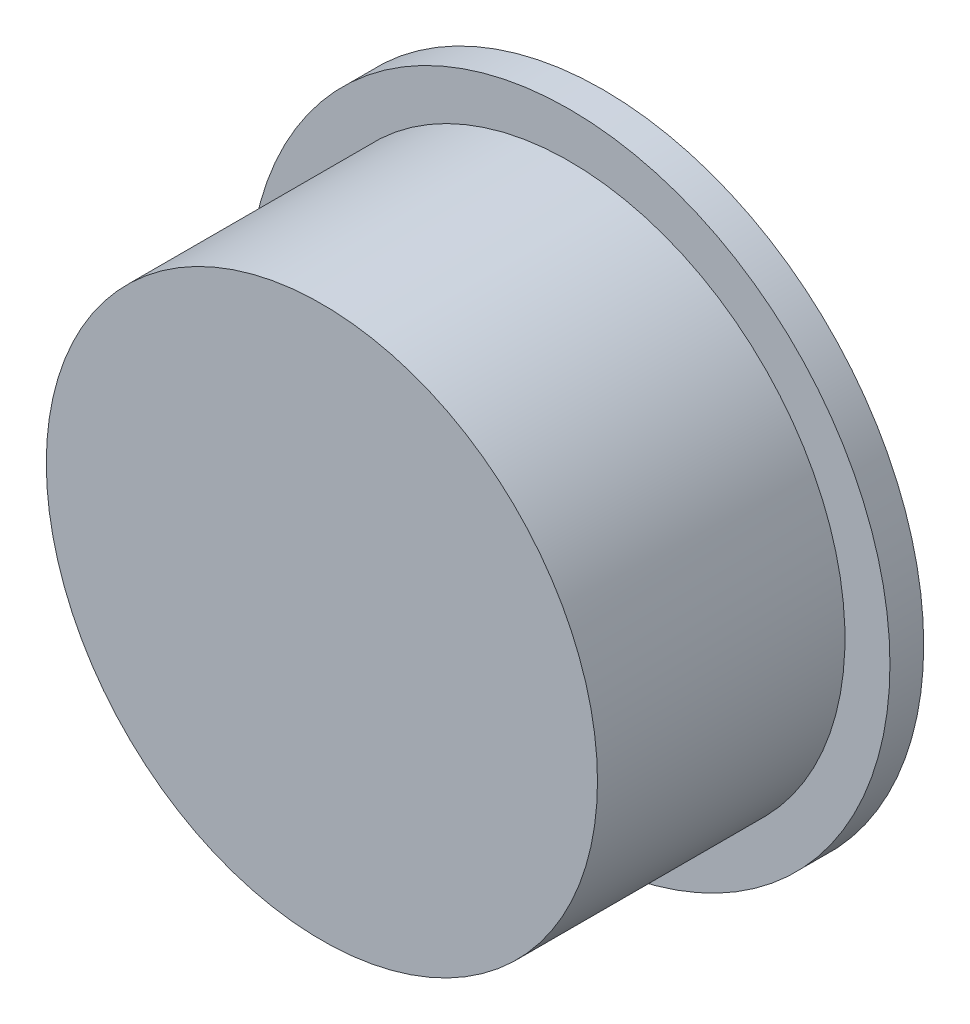
ISO-10303-21;
HEADER;
FILE_DESCRIPTION(('STEP AP214'),'2;1');
FILE_NAME('part.step','',(''),(''),'','','');
FILE_SCHEMA(('AUTOMOTIVE_DESIGN { 1 0 10303 214 1 1 1 1 }'));
ENDSEC;
DATA;
#1=APPLICATION_CONTEXT('core data for automotive mechanical design processes');
#2=APPLICATION_PROTOCOL_DEFINITION('international standard','automotive_design',2000,#1);
#3=PRODUCT_CONTEXT('',#1,'mechanical');
#4=PRODUCT('Part','Part','',(#3));
#5=PRODUCT_RELATED_PRODUCT_CATEGORY('part','',(#4));
#6=PRODUCT_DEFINITION_FORMATION('','',#4);
#7=PRODUCT_DEFINITION_CONTEXT('part definition',#1,'design');
#8=PRODUCT_DEFINITION('design','',#6,#7);
#9=PRODUCT_DEFINITION_SHAPE('','',#8);
#10=(LENGTH_UNIT() NAMED_UNIT(*) SI_UNIT(.MILLI.,.METRE.));
#11=(NAMED_UNIT(*) PLANE_ANGLE_UNIT() SI_UNIT($,.RADIAN.));
#12=(NAMED_UNIT(*) SI_UNIT($,.STERADIAN.) SOLID_ANGLE_UNIT());
#13=UNCERTAINTY_MEASURE_WITH_UNIT(LENGTH_MEASURE(1.E-05),#10,'distance_accuracy_value','');
#14=(GEOMETRIC_REPRESENTATION_CONTEXT(3) GLOBAL_UNCERTAINTY_ASSIGNED_CONTEXT((#13)) GLOBAL_UNIT_ASSIGNED_CONTEXT((#10,
#11,#12)) REPRESENTATION_CONTEXT('',''));
#15=CARTESIAN_POINT('',(0.,0.,0.));
#16=DIRECTION('',(0.,0.,1.));
#17=DIRECTION('',(1.,0.,0.));
#18=AXIS2_PLACEMENT_3D('',#15,#16,#17);
#19=CARTESIAN_POINT('',(-8.52273298087376,9.177701176131,10.));
#20=DIRECTION('',(0.,0.,-1.));
#21=DIRECTION('',(-1.,0.,0.));
#22=AXIS2_PLACEMENT_3D('',#19,#20,#21);
#23=CYLINDRICAL_SURFACE('',#22,22.5);
#24=CARTESIAN_POINT('',(-8.52273298087376,9.177701176131,8.));
#25=DIRECTION('',(0.,0.,1.));
#26=DIRECTION('',(1.,0.,0.));
#27=AXIS2_PLACEMENT_3D('',#24,#25,#26);
#28=CIRCLE('',#27,22.5);
#29=CARTESIAN_POINT('',(13.9772670191262,9.177701176131,8.));
#30=VERTEX_POINT('',#29);
#31=EDGE_CURVE('E159',#30,#30,#28,.T.);
#32=ORIENTED_EDGE('',*,*,#31,.T.);
#33=EDGE_LOOP('',(#32));
#34=FACE_BOUND('',#33,.T.);
#35=CARTESIAN_POINT('',(-8.52273298087376,9.177701176131,-13.));
#36=DIRECTION('',(0.,0.,-1.));
#37=DIRECTION('',(-1.,0.,0.));
#38=AXIS2_PLACEMENT_3D('',#35,#36,#37);
#39=CIRCLE('',#38,22.5);
#40=CARTESIAN_POINT('',(13.4146779876065,4.177701176131,-13.));
#41=VERTEX_POINT('',#40);
#42=CARTESIAN_POINT('',(13.4146779876065,14.177701176131,-13.));
#43=VERTEX_POINT('',#42);
#44=EDGE_CURVE('E125',#41,#43,#39,.F.);
#45=ORIENTED_EDGE('',*,*,#44,.F.);
#46=DIRECTION('',(0.,0.,-1.));
#47=VECTOR('',#46,1.);
#48=CARTESIAN_POINT('',(13.4146779876065,4.177701176131,-13.));
#49=LINE('',#48,#47);
#50=CARTESIAN_POINT('',(13.4146779876065,4.177701176131,-15.));
#51=VERTEX_POINT('',#50);
#52=EDGE_CURVE('E169',#41,#51,#49,.T.);
#53=ORIENTED_EDGE('',*,*,#52,.T.);
#54=CARTESIAN_POINT('',(-8.52273298087376,9.177701176131,-15.));
#55=DIRECTION('',(0.,0.,1.));
#56=DIRECTION('',(1.,0.,0.));
#57=AXIS2_PLACEMENT_3D('',#54,#55,#56);
#58=CIRCLE('',#57,22.5);
#59=CARTESIAN_POINT('',(-30.4601439493541,4.177701176131,-15.));
#60=VERTEX_POINT('',#59);
#61=EDGE_CURVE('E175',#60,#51,#58,.T.);
#62=ORIENTED_EDGE('',*,*,#61,.F.);
#63=DIRECTION('',(0.,0.,-1.));
#64=VECTOR('',#63,1.);
#65=CARTESIAN_POINT('',(-30.4601439493541,4.177701176131,-13.));
#66=LINE('',#65,#64);
#67=CARTESIAN_POINT('',(-30.4601439493541,4.177701176131,-13.));
#68=VERTEX_POINT('',#67);
#69=EDGE_CURVE('E163',#68,#60,#66,.T.);
#70=ORIENTED_EDGE('',*,*,#69,.F.);
#71=CARTESIAN_POINT('',(-8.52273298087376,9.177701176131,-13.));
#72=DIRECTION('',(0.,0.,-1.));
#73=DIRECTION('',(-1.,0.,0.));
#74=AXIS2_PLACEMENT_3D('',#71,#72,#73);
#75=CIRCLE('',#74,22.5);
#76=CARTESIAN_POINT('',(-30.4601439493541,14.177701176131,-13.));
#77=VERTEX_POINT('',#76);
#78=EDGE_CURVE('E141',#77,#68,#75,.F.);
#79=ORIENTED_EDGE('',*,*,#78,.F.);
#80=DIRECTION('',(0.,0.,-1.));
#81=VECTOR('',#80,1.);
#82=CARTESIAN_POINT('',(-30.4601439493541,14.177701176131,-13.));
#83=LINE('',#82,#81);
#84=CARTESIAN_POINT('',(-30.4601439493541,14.177701176131,-15.));
#85=VERTEX_POINT('',#84);
#86=EDGE_CURVE('E160',#77,#85,#83,.T.);
#87=ORIENTED_EDGE('',*,*,#86,.T.);
#88=CARTESIAN_POINT('',(13.4146779876065,14.177701176131,-15.));
#89=VERTEX_POINT('',#88);
#90=EDGE_CURVE('E173',#89,#85,#58,.T.);
#91=ORIENTED_EDGE('',*,*,#90,.F.);
#92=DIRECTION('',(0.,0.,-1.));
#93=VECTOR('',#92,1.);
#94=CARTESIAN_POINT('',(13.4146779876065,14.177701176131,-13.));
#95=LINE('',#94,#93);
#96=EDGE_CURVE('E117',#43,#89,#95,.T.);
#97=ORIENTED_EDGE('',*,*,#96,.F.);
#98=EDGE_LOOP('',(#45,#53,#62,#70,#79,#87,#91,#97));
#99=FACE_BOUND('',#98,.T.);
#100=ADVANCED_FACE('F41',(#34,#99),#23,.F.);
#101=CARTESIAN_POINT('',(-8.52273298087376,9.177701176131,-15.));
#102=DIRECTION('',(0.,0.,1.));
#103=DIRECTION('',(1.,0.,0.));
#104=AXIS2_PLACEMENT_3D('',#101,#102,#103);
#105=PLANE('',#104);
#106=DIRECTION('',(-1.,0.,0.));
#107=VECTOR('',#106,1.);
#108=CARTESIAN_POINT('',(0.,4.17770117613099,-15.));
#109=LINE('',#108,#107);
#110=CARTESIAN_POINT('',(-17.1829870187182,4.177701176131,-15.));
#111=VERTEX_POINT('',#110);
#112=EDGE_CURVE('E56',#111,#60,#109,.T.);
#113=ORIENTED_EDGE('',*,*,#112,.T.);
#114=ORIENTED_EDGE('',*,*,#61,.T.);
#115=DIRECTION('',(1.,0.,0.));
#116=VECTOR('',#115,1.);
#117=CARTESIAN_POINT('',(0.,4.17770117613099,-15.));
#118=LINE('',#117,#116);
#119=CARTESIAN_POINT('',(0.137521056970619,4.17770117613099,-15.));
#120=VERTEX_POINT('',#119);
#121=EDGE_CURVE('E155',#120,#51,#118,.T.);
#122=ORIENTED_EDGE('',*,*,#121,.F.);
#123=CARTESIAN_POINT('',(-8.52273298087377,9.177701176131,-15.));
#124=DIRECTION('',(0.,0.,-1.));
#125=DIRECTION('',(-1.,0.,0.));
#126=AXIS2_PLACEMENT_3D('',#123,#124,#125);
#127=CIRCLE('',#126,10.);
#128=EDGE_CURVE('E153',#120,#111,#127,.T.);
#129=ORIENTED_EDGE('',*,*,#128,.T.);
#130=EDGE_LOOP('',(#113,#114,#122,#129));
#131=FACE_BOUND('',#130,.T.);
#132=ORIENTED_EDGE('',*,*,#90,.T.);
#133=DIRECTION('',(-1.,0.,0.));
#134=VECTOR('',#133,1.);
#135=CARTESIAN_POINT('',(0.,14.177701176131,-15.));
#136=LINE('',#135,#134);
#137=CARTESIAN_POINT('',(-17.1829870187182,14.177701176131,-15.));
#138=VERTEX_POINT('',#137);
#139=EDGE_CURVE('E130',#138,#85,#136,.T.);
#140=ORIENTED_EDGE('',*,*,#139,.F.);
#141=CARTESIAN_POINT('',(0.137521056970621,14.177701176131,-15.));
#142=VERTEX_POINT('',#141);
#143=EDGE_CURVE('E150',#138,#142,#127,.T.);
#144=ORIENTED_EDGE('',*,*,#143,.T.);
#145=DIRECTION('',(1.,0.,0.));
#146=VECTOR('',#145,1.);
#147=CARTESIAN_POINT('',(0.,14.177701176131,-15.));
#148=LINE('',#147,#146);
#149=EDGE_CURVE('E64',#142,#89,#148,.T.);
#150=ORIENTED_EDGE('',*,*,#149,.T.);
#151=EDGE_LOOP('',(#132,#140,#144,#150));
#152=FACE_BOUND('',#151,.T.);
#153=CARTESIAN_POINT('',(-8.52273298087376,9.177701176131,-15.));
#154=DIRECTION('',(0.,0.,-1.));
#155=DIRECTION('',(-1.,0.,0.));
#156=AXIS2_PLACEMENT_3D('',#153,#154,#155);
#157=CIRCLE('',#156,28.5);
#158=CARTESIAN_POINT('',(-37.0227329808738,9.177701176131,-15.));
#159=VERTEX_POINT('',#158);
#160=EDGE_CURVE('E236',#159,#159,#157,.T.);
#161=ORIENTED_EDGE('',*,*,#160,.T.);
#162=EDGE_LOOP('',(#161));
#163=FACE_BOUND('',#162,.T.);
#164=ADVANCED_FACE('F182',(#131,#152,#163),#105,.F.);
#165=CARTESIAN_POINT('',(-8.52273298087376,9.177701176131,8.));
#166=DIRECTION('',(0.,0.,1.));
#167=DIRECTION('',(1.,0.,0.));
#168=AXIS2_PLACEMENT_3D('',#165,#166,#167);
#169=PLANE('',#168);
#170=ORIENTED_EDGE('',*,*,#31,.F.);
#171=EDGE_LOOP('',(#170));
#172=FACE_BOUND('',#171,.T.);
#173=ADVANCED_FACE('F206',(#172),#169,.F.);
#174=CARTESIAN_POINT('',(-8.52273298087377,9.177701176131,-13.));
#175=DIRECTION('',(0.,0.,-1.));
#176=DIRECTION('',(-1.,0.,0.));
#177=AXIS2_PLACEMENT_3D('',#174,#175,#176);
#178=CYLINDRICAL_SURFACE('',#177,10.);
#179=ORIENTED_EDGE('',*,*,#143,.F.);
#180=DIRECTION('',(0.,0.,-1.));
#181=VECTOR('',#180,1.);
#182=CARTESIAN_POINT('',(-17.1829870187182,14.177701176131,-13.));
#183=LINE('',#182,#181);
#184=CARTESIAN_POINT('',(-17.1829870187182,14.177701176131,-13.));
#185=VERTEX_POINT('',#184);
#186=EDGE_CURVE('E128',#185,#138,#183,.T.);
#187=ORIENTED_EDGE('',*,*,#186,.F.);
#188=CARTESIAN_POINT('',(-8.52273298087377,9.177701176131,-13.));
#189=DIRECTION('',(0.,0.,-1.));
#190=DIRECTION('',(-1.,0.,0.));
#191=AXIS2_PLACEMENT_3D('',#188,#189,#190);
#192=CIRCLE('',#191,10.);
#193=CARTESIAN_POINT('',(0.137521056970621,14.177701176131,-13.));
#194=VERTEX_POINT('',#193);
#195=EDGE_CURVE('E123',#185,#194,#192,.T.);
#196=ORIENTED_EDGE('',*,*,#195,.T.);
#197=DIRECTION('',(0.,0.,-1.));
#198=VECTOR('',#197,1.);
#199=CARTESIAN_POINT('',(0.137521056970621,14.177701176131,-13.));
#200=LINE('',#199,#198);
#201=EDGE_CURVE('E109',#194,#142,#200,.T.);
#202=ORIENTED_EDGE('',*,*,#201,.T.);
#203=EDGE_LOOP('',(#179,#187,#196,#202));
#204=FACE_BOUND('',#203,.T.);
#205=ADVANCED_FACE('F127',(#204),#178,.T.);
#206=CARTESIAN_POINT('',(0.,14.177701176131,-13.));
#207=DIRECTION('',(0.,-1.,0.));
#208=DIRECTION('',(0.,0.,-1.));
#209=AXIS2_PLACEMENT_3D('',#206,#207,#208);
#210=PLANE('',#209);
#211=ORIENTED_EDGE('',*,*,#139,.T.);
#212=ORIENTED_EDGE('',*,*,#86,.F.);
#213=DIRECTION('',(-1.,0.,0.));
#214=VECTOR('',#213,1.);
#215=CARTESIAN_POINT('',(0.,14.177701176131,-13.));
#216=LINE('',#215,#214);
#217=EDGE_CURVE('E118',#185,#77,#216,.T.);
#218=ORIENTED_EDGE('',*,*,#217,.F.);
#219=ORIENTED_EDGE('',*,*,#186,.T.);
#220=EDGE_LOOP('',(#211,#212,#218,#219));
#221=FACE_BOUND('',#220,.T.);
#222=ADVANCED_FACE('F198',(#221),#210,.F.);
#223=CARTESIAN_POINT('',(0.,4.17770117613099,-13.));
#224=DIRECTION('',(0.,-1.,0.));
#225=DIRECTION('',(1.,0.,0.));
#226=AXIS2_PLACEMENT_3D('',#223,#224,#225);
#227=PLANE('',#226);
#228=ORIENTED_EDGE('',*,*,#112,.F.);
#229=DIRECTION('',(0.,0.,-1.));
#230=VECTOR('',#229,1.);
#231=CARTESIAN_POINT('',(-17.1829870187182,4.177701176131,-13.));
#232=LINE('',#231,#230);
#233=CARTESIAN_POINT('',(-17.1829870187182,4.177701176131,-13.));
#234=VERTEX_POINT('',#233);
#235=EDGE_CURVE('E165',#234,#111,#232,.T.);
#236=ORIENTED_EDGE('',*,*,#235,.F.);
#237=DIRECTION('',(-1.,0.,0.));
#238=VECTOR('',#237,1.);
#239=CARTESIAN_POINT('',(0.,4.17770117613099,-13.));
#240=LINE('',#239,#238);
#241=EDGE_CURVE('E136',#234,#68,#240,.T.);
#242=ORIENTED_EDGE('',*,*,#241,.T.);
#243=ORIENTED_EDGE('',*,*,#69,.T.);
#244=EDGE_LOOP('',(#228,#236,#242,#243));
#245=FACE_BOUND('',#244,.T.);
#246=ADVANCED_FACE('F192',(#245),#227,.T.);
#247=ORIENTED_EDGE('',*,*,#128,.F.);
#248=DIRECTION('',(0.,0.,-1.));
#249=VECTOR('',#248,1.);
#250=CARTESIAN_POINT('',(0.137521056970619,4.17770117613099,-13.));
#251=LINE('',#250,#249);
#252=CARTESIAN_POINT('',(0.137521056970619,4.17770117613099,-13.));
#253=VERTEX_POINT('',#252);
#254=EDGE_CURVE('E167',#253,#120,#251,.T.);
#255=ORIENTED_EDGE('',*,*,#254,.F.);
#256=EDGE_CURVE('E132',#253,#234,#192,.T.);
#257=ORIENTED_EDGE('',*,*,#256,.T.);
#258=ORIENTED_EDGE('',*,*,#235,.T.);
#259=EDGE_LOOP('',(#247,#255,#257,#258));
#260=FACE_BOUND('',#259,.T.);
#261=ADVANCED_FACE('F189',(#260),#178,.T.);
#262=CARTESIAN_POINT('',(0.,4.17770117613099,-13.));
#263=DIRECTION('',(0.,1.,0.));
#264=DIRECTION('',(-1.,0.,0.));
#265=AXIS2_PLACEMENT_3D('',#262,#263,#264);
#266=PLANE('',#265);
#267=ORIENTED_EDGE('',*,*,#121,.T.);
#268=ORIENTED_EDGE('',*,*,#52,.F.);
#269=DIRECTION('',(1.,0.,0.));
#270=VECTOR('',#269,1.);
#271=CARTESIAN_POINT('',(0.,4.17770117613099,-13.));
#272=LINE('',#271,#270);
#273=EDGE_CURVE('E137',#253,#41,#272,.T.);
#274=ORIENTED_EDGE('',*,*,#273,.F.);
#275=ORIENTED_EDGE('',*,*,#254,.T.);
#276=EDGE_LOOP('',(#267,#268,#274,#275));
#277=FACE_BOUND('',#276,.T.);
#278=ADVANCED_FACE('F188',(#277),#266,.F.);
#279=CARTESIAN_POINT('',(0.,14.177701176131,-13.));
#280=DIRECTION('',(0.,1.,0.));
#281=DIRECTION('',(0.,0.,1.));
#282=AXIS2_PLACEMENT_3D('',#279,#280,#281);
#283=PLANE('',#282);
#284=ORIENTED_EDGE('',*,*,#149,.F.);
#285=ORIENTED_EDGE('',*,*,#201,.F.);
#286=DIRECTION('',(1.,0.,0.));
#287=VECTOR('',#286,1.);
#288=CARTESIAN_POINT('',(0.,14.177701176131,-13.));
#289=LINE('',#288,#287);
#290=EDGE_CURVE('E112',#194,#43,#289,.T.);
#291=ORIENTED_EDGE('',*,*,#290,.T.);
#292=ORIENTED_EDGE('',*,*,#96,.T.);
#293=EDGE_LOOP('',(#284,#285,#291,#292));
#294=FACE_BOUND('',#293,.T.);
#295=ADVANCED_FACE('F111',(#294),#283,.T.);
#296=CARTESIAN_POINT('',(0.,0.,-13.));
#297=DIRECTION('',(0.,0.,-1.));
#298=DIRECTION('',(-1.,0.,0.));
#299=AXIS2_PLACEMENT_3D('',#296,#297,#298);
#300=PLANE('',#299);
#301=ORIENTED_EDGE('',*,*,#195,.F.);
#302=ORIENTED_EDGE('',*,*,#217,.T.);
#303=ORIENTED_EDGE('',*,*,#78,.T.);
#304=ORIENTED_EDGE('',*,*,#241,.F.);
#305=ORIENTED_EDGE('',*,*,#256,.F.);
#306=ORIENTED_EDGE('',*,*,#273,.T.);
#307=ORIENTED_EDGE('',*,*,#44,.T.);
#308=ORIENTED_EDGE('',*,*,#290,.F.);
#309=EDGE_LOOP('',(#301,#302,#303,#304,#305,#306,#307,#308));
#310=FACE_BOUND('',#309,.T.);
#311=ADVANCED_FACE('F122',(#310),#300,.F.);
#312=CARTESIAN_POINT('',(-8.52273298087376,9.177701176131,-12.));
#313=DIRECTION('',(0.,0.,-1.));
#314=DIRECTION('',(-1.,0.,0.));
#315=AXIS2_PLACEMENT_3D('',#312,#313,#314);
#316=CYLINDRICAL_SURFACE('',#315,28.5);
#317=CARTESIAN_POINT('',(-8.52273298087376,9.177701176131,-12.));
#318=DIRECTION('',(0.,0.,-1.));
#319=DIRECTION('',(-1.,0.,0.));
#320=AXIS2_PLACEMENT_3D('',#317,#318,#319);
#321=CIRCLE('',#320,28.5);
#322=CARTESIAN_POINT('',(-37.0227329808738,9.177701176131,-12.));
#323=VERTEX_POINT('',#322);
#324=EDGE_CURVE('E152',#323,#323,#321,.T.);
#325=ORIENTED_EDGE('',*,*,#324,.T.);
#326=EDGE_LOOP('',(#325));
#327=FACE_BOUND('',#326,.T.);
#328=ORIENTED_EDGE('',*,*,#160,.F.);
#329=EDGE_LOOP('',(#328));
#330=FACE_BOUND('',#329,.T.);
#331=ADVANCED_FACE('F226',(#327,#330),#316,.T.);
#332=CARTESIAN_POINT('',(-8.52273298087376,9.177701176131,-12.));
#333=DIRECTION('',(0.,0.,-1.));
#334=DIRECTION('',(-1.,0.,0.));
#335=AXIS2_PLACEMENT_3D('',#332,#333,#334);
#336=PLANE('',#335);
#337=CARTESIAN_POINT('',(-8.52273298087376,9.177701176131,-12.));
#338=DIRECTION('',(0.,0.,-1.));
#339=DIRECTION('',(-1.,0.,0.));
#340=AXIS2_PLACEMENT_3D('',#337,#338,#339);
#341=CIRCLE('',#340,24.5);
#342=CARTESIAN_POINT('',(-33.0227329808738,9.177701176131,-12.));
#343=VERTEX_POINT('',#342);
#344=EDGE_CURVE('E11',#343,#343,#341,.T.);
#345=ORIENTED_EDGE('',*,*,#344,.T.);
#346=EDGE_LOOP('',(#345));
#347=FACE_BOUND('',#346,.T.);
#348=ORIENTED_EDGE('',*,*,#324,.F.);
#349=EDGE_LOOP('',(#348));
#350=FACE_BOUND('',#349,.T.);
#351=ADVANCED_FACE('F219',(#347,#350),#336,.F.);
#352=CARTESIAN_POINT('',(-8.52273298087376,9.177701176131,10.));
#353=DIRECTION('',(0.,0.,1.));
#354=DIRECTION('',(1.,0.,0.));
#355=AXIS2_PLACEMENT_3D('',#352,#353,#354);
#356=PLANE('',#355);
#357=CARTESIAN_POINT('',(-8.52273298087376,9.177701176131,10.));
#358=DIRECTION('',(0.,0.,1.));
#359=DIRECTION('',(1.,0.,0.));
#360=AXIS2_PLACEMENT_3D('',#357,#358,#359);
#361=CIRCLE('',#360,24.5);
#362=CARTESIAN_POINT('',(15.9772670191262,9.177701176131,10.));
#363=VERTEX_POINT('',#362);
#364=EDGE_CURVE('E49',#363,#363,#361,.T.);
#365=ORIENTED_EDGE('',*,*,#364,.T.);
#366=EDGE_LOOP('',(#365));
#367=FACE_BOUND('',#366,.T.);
#368=ADVANCED_FACE('F217',(#367),#356,.T.);
#369=CARTESIAN_POINT('',(-8.52273298087376,9.177701176131,10.));
#370=DIRECTION('',(0.,0.,-1.));
#371=DIRECTION('',(-1.,0.,0.));
#372=AXIS2_PLACEMENT_3D('',#369,#370,#371);
#373=CYLINDRICAL_SURFACE('',#372,24.5);
#374=ORIENTED_EDGE('',*,*,#364,.F.);
#375=EDGE_LOOP('',(#374));
#376=FACE_BOUND('',#375,.T.);
#377=ORIENTED_EDGE('',*,*,#344,.F.);
#378=EDGE_LOOP('',(#377));
#379=FACE_BOUND('',#378,.T.);
#380=ADVANCED_FACE('F43',(#376,#379),#373,.T.);
#381=CLOSED_SHELL('',(#100,#164,#173,#205,#222,#246,#261,#278,#295,#311,#331,#351,#368,#380));
#382=MANIFOLD_SOLID_BREP('B2',#381);
#383=ADVANCED_BREP_SHAPE_REPRESENTATION('',(#18,#382),#14);
#384=SHAPE_DEFINITION_REPRESENTATION(#9,#383);
ENDSEC;
END-ISO-10303-21;
